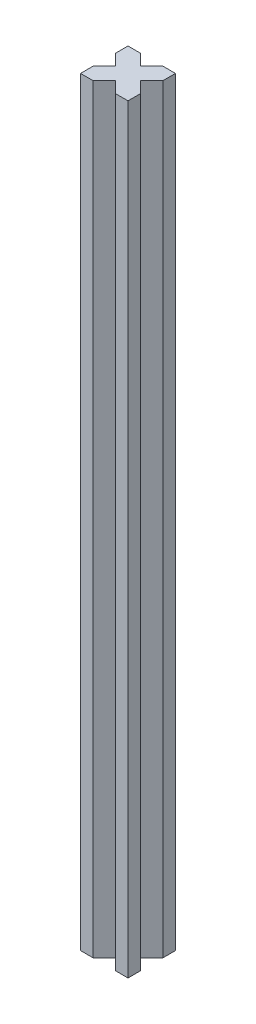
ISO-10303-21;
HEADER;
FILE_DESCRIPTION(('STEP AP214'),'2;1');
FILE_NAME('part.step','',(''),(''),'','','');
FILE_SCHEMA(('AUTOMOTIVE_DESIGN { 1 0 10303 214 1 1 1 1 }'));
ENDSEC;
DATA;
#1=APPLICATION_CONTEXT('core data for automotive mechanical design processes');
#2=APPLICATION_PROTOCOL_DEFINITION('international standard','automotive_design',2000,#1);
#3=PRODUCT_CONTEXT('',#1,'mechanical');
#4=PRODUCT('Part','Part','',(#3));
#5=PRODUCT_RELATED_PRODUCT_CATEGORY('part','',(#4));
#6=PRODUCT_DEFINITION_FORMATION('','',#4);
#7=PRODUCT_DEFINITION_CONTEXT('part definition',#1,'design');
#8=PRODUCT_DEFINITION('design','',#6,#7);
#9=PRODUCT_DEFINITION_SHAPE('','',#8);
#10=(LENGTH_UNIT() NAMED_UNIT(*) SI_UNIT(.MILLI.,.METRE.));
#11=(NAMED_UNIT(*) PLANE_ANGLE_UNIT() SI_UNIT($,.RADIAN.));
#12=(NAMED_UNIT(*) SI_UNIT($,.STERADIAN.) SOLID_ANGLE_UNIT());
#13=UNCERTAINTY_MEASURE_WITH_UNIT(LENGTH_MEASURE(1.E-05),#10,'distance_accuracy_value','');
#14=(GEOMETRIC_REPRESENTATION_CONTEXT(3) GLOBAL_UNCERTAINTY_ASSIGNED_CONTEXT((#13)) GLOBAL_UNIT_ASSIGNED_CONTEXT((#10,
#11,#12)) REPRESENTATION_CONTEXT('',''));
#15=CARTESIAN_POINT('',(0.,0.,0.));
#16=DIRECTION('',(0.,0.,1.));
#17=DIRECTION('',(1.,0.,0.));
#18=AXIS2_PLACEMENT_3D('',#15,#16,#17);
#19=CARTESIAN_POINT('',(4.00000000000001,240.,-15.));
#20=DIRECTION('',(-0.707106781186549,0.,0.707106781186546));
#21=DIRECTION('',(0.707106781186546,0.,0.707106781186549));
#22=AXIS2_PLACEMENT_3D('',#19,#20,#21);
#23=PLANE('',#22);
#24=DIRECTION('',(-0.707106781186546,0.,-0.707106781186549));
#25=VECTOR('',#24,1.);
#26=CARTESIAN_POINT('',(4.00000000000001,0.,-15.));
#27=LINE('',#26,#25);
#28=CARTESIAN_POINT('',(7.5,0.,-11.5));
#29=VERTEX_POINT('',#28);
#30=CARTESIAN_POINT('',(4.00000000000001,0.,-15.));
#31=VERTEX_POINT('',#30);
#32=EDGE_CURVE('E185',#29,#31,#27,.T.);
#33=ORIENTED_EDGE('',*,*,#32,.T.);
#34=DIRECTION('',(0.,-1.,0.));
#35=VECTOR('',#34,1.);
#36=CARTESIAN_POINT('',(4.00000000000001,240.,-15.));
#37=LINE('',#36,#35);
#38=CARTESIAN_POINT('',(4.00000000000001,240.,-15.));
#39=VERTEX_POINT('',#38);
#40=EDGE_CURVE('E11',#39,#31,#37,.T.);
#41=ORIENTED_EDGE('',*,*,#40,.F.);
#42=DIRECTION('',(-0.707106781186546,0.,-0.707106781186549));
#43=VECTOR('',#42,1.);
#44=CARTESIAN_POINT('',(4.00000000000001,240.,-15.));
#45=LINE('',#44,#43);
#46=CARTESIAN_POINT('',(7.5,240.,-11.5));
#47=VERTEX_POINT('',#46);
#48=EDGE_CURVE('E231',#47,#39,#45,.T.);
#49=ORIENTED_EDGE('',*,*,#48,.F.);
#50=DIRECTION('',(0.,-1.,0.));
#51=VECTOR('',#50,1.);
#52=CARTESIAN_POINT('',(7.5,240.,-11.5));
#53=LINE('',#52,#51);
#54=EDGE_CURVE('E181',#47,#29,#53,.T.);
#55=ORIENTED_EDGE('',*,*,#54,.T.);
#56=EDGE_LOOP('',(#33,#41,#49,#55));
#57=FACE_BOUND('',#56,.T.);
#58=ADVANCED_FACE('F36',(#57),#23,.F.);
#59=CARTESIAN_POINT('',(0.,240.,-15.));
#60=DIRECTION('',(0.,0.,1.));
#61=DIRECTION('',(1.,0.,0.));
#62=AXIS2_PLACEMENT_3D('',#59,#60,#61);
#63=PLANE('',#62);
#64=DIRECTION('',(-1.,0.,0.));
#65=VECTOR('',#64,1.);
#66=CARTESIAN_POINT('',(0.,0.,-15.));
#67=LINE('',#66,#65);
#68=CARTESIAN_POINT('',(0.,0.,-15.));
#69=VERTEX_POINT('',#68);
#70=EDGE_CURVE('E189',#31,#69,#67,.T.);
#71=ORIENTED_EDGE('',*,*,#70,.T.);
#72=DIRECTION('',(0.,-1.,0.));
#73=VECTOR('',#72,1.);
#74=CARTESIAN_POINT('',(0.,240.,-15.));
#75=LINE('',#74,#73);
#76=CARTESIAN_POINT('',(0.,240.,-15.));
#77=VERTEX_POINT('',#76);
#78=EDGE_CURVE('E45',#77,#69,#75,.T.);
#79=ORIENTED_EDGE('',*,*,#78,.F.);
#80=DIRECTION('',(-1.,0.,0.));
#81=VECTOR('',#80,1.);
#82=CARTESIAN_POINT('',(0.,240.,-15.));
#83=LINE('',#82,#81);
#84=EDGE_CURVE('E120',#39,#77,#83,.T.);
#85=ORIENTED_EDGE('',*,*,#84,.F.);
#86=ORIENTED_EDGE('',*,*,#40,.T.);
#87=EDGE_LOOP('',(#71,#79,#85,#86));
#88=FACE_BOUND('',#87,.T.);
#89=ADVANCED_FACE('F353',(#88),#63,.F.);
#90=CARTESIAN_POINT('',(0.,240.,-11.));
#91=DIRECTION('',(1.,0.,0.));
#92=DIRECTION('',(0.,0.,-1.));
#93=AXIS2_PLACEMENT_3D('',#90,#91,#92);
#94=PLANE('',#93);
#95=DIRECTION('',(0.,0.,1.));
#96=VECTOR('',#95,1.);
#97=CARTESIAN_POINT('',(0.,0.,-11.));
#98=LINE('',#97,#96);
#99=CARTESIAN_POINT('',(0.,0.,-11.));
#100=VERTEX_POINT('',#99);
#101=EDGE_CURVE('E192',#69,#100,#98,.T.);
#102=ORIENTED_EDGE('',*,*,#101,.T.);
#103=DIRECTION('',(0.,-1.,0.));
#104=VECTOR('',#103,1.);
#105=CARTESIAN_POINT('',(0.,240.,-11.));
#106=LINE('',#105,#104);
#107=CARTESIAN_POINT('',(0.,240.,-11.));
#108=VERTEX_POINT('',#107);
#109=EDGE_CURVE('E274',#108,#100,#106,.T.);
#110=ORIENTED_EDGE('',*,*,#109,.F.);
#111=DIRECTION('',(0.,0.,1.));
#112=VECTOR('',#111,1.);
#113=CARTESIAN_POINT('',(0.,240.,-11.));
#114=LINE('',#113,#112);
#115=EDGE_CURVE('E284',#77,#108,#114,.T.);
#116=ORIENTED_EDGE('',*,*,#115,.F.);
#117=ORIENTED_EDGE('',*,*,#78,.T.);
#118=EDGE_LOOP('',(#102,#110,#116,#117));
#119=FACE_BOUND('',#118,.T.);
#120=ADVANCED_FACE('F282',(#119),#94,.F.);
#121=CARTESIAN_POINT('',(3.5,240.,-7.5));
#122=DIRECTION('',(0.707106781186548,0.,-0.707106781186547));
#123=DIRECTION('',(-0.707106781186547,0.,-0.707106781186548));
#124=AXIS2_PLACEMENT_3D('',#121,#122,#123);
#125=PLANE('',#124);
#126=DIRECTION('',(0.707106781186547,0.,0.707106781186548));
#127=VECTOR('',#126,1.);
#128=CARTESIAN_POINT('',(3.5,0.,-7.5));
#129=LINE('',#128,#127);
#130=CARTESIAN_POINT('',(3.5,0.,-7.5));
#131=VERTEX_POINT('',#130);
#132=EDGE_CURVE('E195',#100,#131,#129,.T.);
#133=ORIENTED_EDGE('',*,*,#132,.T.);
#134=DIRECTION('',(0.,-1.,0.));
#135=VECTOR('',#134,1.);
#136=CARTESIAN_POINT('',(3.5,240.,-7.5));
#137=LINE('',#136,#135);
#138=CARTESIAN_POINT('',(3.5,240.,-7.5));
#139=VERTEX_POINT('',#138);
#140=EDGE_CURVE('E270',#139,#131,#137,.T.);
#141=ORIENTED_EDGE('',*,*,#140,.F.);
#142=DIRECTION('',(0.707106781186547,0.,0.707106781186548));
#143=VECTOR('',#142,1.);
#144=CARTESIAN_POINT('',(3.5,240.,-7.5));
#145=LINE('',#144,#143);
#146=EDGE_CURVE('E303',#108,#139,#145,.T.);
#147=ORIENTED_EDGE('',*,*,#146,.F.);
#148=ORIENTED_EDGE('',*,*,#109,.T.);
#149=EDGE_LOOP('',(#133,#141,#147,#148));
#150=FACE_BOUND('',#149,.T.);
#151=ADVANCED_FACE('F293',(#150),#125,.F.);
#152=CARTESIAN_POINT('',(0.,240.,-4.00000000000001));
#153=DIRECTION('',(0.707106781186546,0.,0.707106781186549));
#154=DIRECTION('',(0.707106781186549,0.,-0.707106781186546));
#155=AXIS2_PLACEMENT_3D('',#152,#153,#154);
#156=PLANE('',#155);
#157=DIRECTION('',(-0.707106781186549,0.,0.707106781186546));
#158=VECTOR('',#157,1.);
#159=CARTESIAN_POINT('',(0.,0.,-4.00000000000001));
#160=LINE('',#159,#158);
#161=CARTESIAN_POINT('',(0.,0.,-4.00000000000001));
#162=VERTEX_POINT('',#161);
#163=EDGE_CURVE('E198',#131,#162,#160,.T.);
#164=ORIENTED_EDGE('',*,*,#163,.T.);
#165=DIRECTION('',(0.,-1.,0.));
#166=VECTOR('',#165,1.);
#167=CARTESIAN_POINT('',(0.,240.,-4.00000000000001));
#168=LINE('',#167,#166);
#169=CARTESIAN_POINT('',(0.,240.,-4.00000000000001));
#170=VERTEX_POINT('',#169);
#171=EDGE_CURVE('E266',#170,#162,#168,.T.);
#172=ORIENTED_EDGE('',*,*,#171,.F.);
#173=DIRECTION('',(-0.707106781186549,0.,0.707106781186546));
#174=VECTOR('',#173,1.);
#175=CARTESIAN_POINT('',(0.,240.,-4.00000000000001));
#176=LINE('',#175,#174);
#177=EDGE_CURVE('E299',#139,#170,#176,.T.);
#178=ORIENTED_EDGE('',*,*,#177,.F.);
#179=ORIENTED_EDGE('',*,*,#140,.T.);
#180=EDGE_LOOP('',(#164,#172,#178,#179));
#181=FACE_BOUND('',#180,.T.);
#182=ADVANCED_FACE('F297',(#181),#156,.F.);
#183=CARTESIAN_POINT('',(0.,240.,0.));
#184=DIRECTION('',(1.,0.,0.));
#185=DIRECTION('',(0.,0.,-1.));
#186=AXIS2_PLACEMENT_3D('',#183,#184,#185);
#187=PLANE('',#186);
#188=DIRECTION('',(0.,0.,1.));
#189=VECTOR('',#188,1.);
#190=CARTESIAN_POINT('',(0.,0.,0.));
#191=LINE('',#190,#189);
#192=CARTESIAN_POINT('',(0.,0.,0.));
#193=VERTEX_POINT('',#192);
#194=EDGE_CURVE('E201',#162,#193,#191,.T.);
#195=ORIENTED_EDGE('',*,*,#194,.T.);
#196=DIRECTION('',(0.,-1.,0.));
#197=VECTOR('',#196,1.);
#198=CARTESIAN_POINT('',(0.,240.,0.));
#199=LINE('',#198,#197);
#200=CARTESIAN_POINT('',(0.,240.,0.));
#201=VERTEX_POINT('',#200);
#202=EDGE_CURVE('E262',#201,#193,#199,.T.);
#203=ORIENTED_EDGE('',*,*,#202,.F.);
#204=DIRECTION('',(0.,0.,1.));
#205=VECTOR('',#204,1.);
#206=CARTESIAN_POINT('',(0.,240.,0.));
#207=LINE('',#206,#205);
#208=EDGE_CURVE('E302',#170,#201,#207,.T.);
#209=ORIENTED_EDGE('',*,*,#208,.F.);
#210=ORIENTED_EDGE('',*,*,#171,.T.);
#211=EDGE_LOOP('',(#195,#203,#209,#210));
#212=FACE_BOUND('',#211,.T.);
#213=ADVANCED_FACE('F366',(#212),#187,.F.);
#214=CARTESIAN_POINT('',(0.,240.,0.));
#215=DIRECTION('',(0.,0.,-1.));
#216=DIRECTION('',(-1.,0.,0.));
#217=AXIS2_PLACEMENT_3D('',#214,#215,#216);
#218=PLANE('',#217);
#219=DIRECTION('',(1.,0.,0.));
#220=VECTOR('',#219,1.);
#221=CARTESIAN_POINT('',(0.,0.,0.));
#222=LINE('',#221,#220);
#223=CARTESIAN_POINT('',(4.00000000000004,0.,0.));
#224=VERTEX_POINT('',#223);
#225=EDGE_CURVE('E204',#193,#224,#222,.T.);
#226=ORIENTED_EDGE('',*,*,#225,.T.);
#227=DIRECTION('',(0.,-1.,0.));
#228=VECTOR('',#227,1.);
#229=CARTESIAN_POINT('',(4.00000000000004,240.,0.));
#230=LINE('',#229,#228);
#231=CARTESIAN_POINT('',(4.00000000000004,240.,0.));
#232=VERTEX_POINT('',#231);
#233=EDGE_CURVE('E258',#232,#224,#230,.T.);
#234=ORIENTED_EDGE('',*,*,#233,.F.);
#235=DIRECTION('',(1.,0.,0.));
#236=VECTOR('',#235,1.);
#237=CARTESIAN_POINT('',(0.,240.,0.));
#238=LINE('',#237,#236);
#239=EDGE_CURVE('E307',#201,#232,#238,.T.);
#240=ORIENTED_EDGE('',*,*,#239,.F.);
#241=ORIENTED_EDGE('',*,*,#202,.T.);
#242=EDGE_LOOP('',(#226,#234,#240,#241));
#243=FACE_BOUND('',#242,.T.);
#244=ADVANCED_FACE('F369',(#243),#218,.F.);
#245=CARTESIAN_POINT('',(7.5,240.,-3.5));
#246=DIRECTION('',(-0.707106781186551,0.,-0.707106781186544));
#247=DIRECTION('',(-0.707106781186544,0.,0.707106781186551));
#248=AXIS2_PLACEMENT_3D('',#245,#246,#247);
#249=PLANE('',#248);
#250=DIRECTION('',(0.707106781186544,0.,-0.707106781186551));
#251=VECTOR('',#250,1.);
#252=CARTESIAN_POINT('',(7.5,0.,-3.5));
#253=LINE('',#252,#251);
#254=CARTESIAN_POINT('',(7.5,0.,-3.5));
#255=VERTEX_POINT('',#254);
#256=EDGE_CURVE('E207',#224,#255,#253,.T.);
#257=ORIENTED_EDGE('',*,*,#256,.T.);
#258=DIRECTION('',(0.,-1.,0.));
#259=VECTOR('',#258,1.);
#260=CARTESIAN_POINT('',(7.5,240.,-3.5));
#261=LINE('',#260,#259);
#262=CARTESIAN_POINT('',(7.5,240.,-3.5));
#263=VERTEX_POINT('',#262);
#264=EDGE_CURVE('E254',#263,#255,#261,.T.);
#265=ORIENTED_EDGE('',*,*,#264,.F.);
#266=DIRECTION('',(0.707106781186544,0.,-0.707106781186551));
#267=VECTOR('',#266,1.);
#268=CARTESIAN_POINT('',(7.5,240.,-3.5));
#269=LINE('',#268,#267);
#270=EDGE_CURVE('E314',#232,#263,#269,.T.);
#271=ORIENTED_EDGE('',*,*,#270,.F.);
#272=ORIENTED_EDGE('',*,*,#233,.T.);
#273=EDGE_LOOP('',(#257,#265,#271,#272));
#274=FACE_BOUND('',#273,.T.);
#275=ADVANCED_FACE('F373',(#274),#249,.F.);
#276=CARTESIAN_POINT('',(11.,240.,0.));
#277=DIRECTION('',(0.707106781186544,0.,-0.707106781186551));
#278=DIRECTION('',(-0.707106781186551,0.,-0.707106781186544));
#279=AXIS2_PLACEMENT_3D('',#276,#277,#278);
#280=PLANE('',#279);
#281=DIRECTION('',(0.707106781186551,0.,0.707106781186544));
#282=VECTOR('',#281,1.);
#283=CARTESIAN_POINT('',(11.,0.,0.));
#284=LINE('',#283,#282);
#285=CARTESIAN_POINT('',(11.,0.,0.));
#286=VERTEX_POINT('',#285);
#287=EDGE_CURVE('E210',#255,#286,#284,.T.);
#288=ORIENTED_EDGE('',*,*,#287,.T.);
#289=DIRECTION('',(0.,-1.,0.));
#290=VECTOR('',#289,1.);
#291=CARTESIAN_POINT('',(11.,240.,0.));
#292=LINE('',#291,#290);
#293=CARTESIAN_POINT('',(11.,240.,0.));
#294=VERTEX_POINT('',#293);
#295=EDGE_CURVE('E250',#294,#286,#292,.T.);
#296=ORIENTED_EDGE('',*,*,#295,.F.);
#297=DIRECTION('',(0.707106781186551,0.,0.707106781186544));
#298=VECTOR('',#297,1.);
#299=CARTESIAN_POINT('',(11.,240.,0.));
#300=LINE('',#299,#298);
#301=EDGE_CURVE('E317',#263,#294,#300,.T.);
#302=ORIENTED_EDGE('',*,*,#301,.F.);
#303=ORIENTED_EDGE('',*,*,#264,.T.);
#304=EDGE_LOOP('',(#288,#296,#302,#303));
#305=FACE_BOUND('',#304,.T.);
#306=ADVANCED_FACE('F377',(#305),#280,.F.);
#307=CARTESIAN_POINT('',(11.,240.,0.));
#308=DIRECTION('',(0.,0.,-1.));
#309=DIRECTION('',(-1.,0.,0.));
#310=AXIS2_PLACEMENT_3D('',#307,#308,#309);
#311=PLANE('',#310);
#312=DIRECTION('',(1.,0.,0.));
#313=VECTOR('',#312,1.);
#314=CARTESIAN_POINT('',(11.,0.,0.));
#315=LINE('',#314,#313);
#316=CARTESIAN_POINT('',(15.,0.,0.));
#317=VERTEX_POINT('',#316);
#318=EDGE_CURVE('E213',#286,#317,#315,.T.);
#319=ORIENTED_EDGE('',*,*,#318,.T.);
#320=DIRECTION('',(0.,-1.,0.));
#321=VECTOR('',#320,1.);
#322=CARTESIAN_POINT('',(15.,240.,0.));
#323=LINE('',#322,#321);
#324=CARTESIAN_POINT('',(15.,240.,0.));
#325=VERTEX_POINT('',#324);
#326=EDGE_CURVE('E246',#325,#317,#323,.T.);
#327=ORIENTED_EDGE('',*,*,#326,.F.);
#328=DIRECTION('',(1.,0.,0.));
#329=VECTOR('',#328,1.);
#330=CARTESIAN_POINT('',(11.,240.,0.));
#331=LINE('',#330,#329);
#332=EDGE_CURVE('E320',#294,#325,#331,.T.);
#333=ORIENTED_EDGE('',*,*,#332,.F.);
#334=ORIENTED_EDGE('',*,*,#295,.T.);
#335=EDGE_LOOP('',(#319,#327,#333,#334));
#336=FACE_BOUND('',#335,.T.);
#337=ADVANCED_FACE('F381',(#336),#311,.F.);
#338=CARTESIAN_POINT('',(15.,240.,0.));
#339=DIRECTION('',(-1.,0.,0.));
#340=DIRECTION('',(0.,0.,1.));
#341=AXIS2_PLACEMENT_3D('',#338,#339,#340);
#342=PLANE('',#341);
#343=DIRECTION('',(0.,0.,-1.));
#344=VECTOR('',#343,1.);
#345=CARTESIAN_POINT('',(15.,0.,0.));
#346=LINE('',#345,#344);
#347=CARTESIAN_POINT('',(15.,0.,-3.99999999999996));
#348=VERTEX_POINT('',#347);
#349=EDGE_CURVE('E216',#317,#348,#346,.T.);
#350=ORIENTED_EDGE('',*,*,#349,.T.);
#351=DIRECTION('',(0.,-1.,0.));
#352=VECTOR('',#351,1.);
#353=CARTESIAN_POINT('',(15.,240.,-3.99999999999996));
#354=LINE('',#353,#352);
#355=CARTESIAN_POINT('',(15.,240.,-3.99999999999996));
#356=VERTEX_POINT('',#355);
#357=EDGE_CURVE('E242',#356,#348,#354,.T.);
#358=ORIENTED_EDGE('',*,*,#357,.F.);
#359=DIRECTION('',(0.,0.,-1.));
#360=VECTOR('',#359,1.);
#361=CARTESIAN_POINT('',(15.,240.,0.));
#362=LINE('',#361,#360);
#363=EDGE_CURVE('E323',#325,#356,#362,.T.);
#364=ORIENTED_EDGE('',*,*,#363,.F.);
#365=ORIENTED_EDGE('',*,*,#326,.T.);
#366=EDGE_LOOP('',(#350,#358,#364,#365));
#367=FACE_BOUND('',#366,.T.);
#368=ADVANCED_FACE('F385',(#367),#342,.F.);
#369=CARTESIAN_POINT('',(11.5,240.,-7.5));
#370=DIRECTION('',(-0.707106781186551,0.,0.707106781186544));
#371=DIRECTION('',(0.707106781186544,0.,0.707106781186551));
#372=AXIS2_PLACEMENT_3D('',#369,#370,#371);
#373=PLANE('',#372);
#374=DIRECTION('',(-0.707106781186544,0.,-0.707106781186551));
#375=VECTOR('',#374,1.);
#376=CARTESIAN_POINT('',(11.5,0.,-7.5));
#377=LINE('',#376,#375);
#378=CARTESIAN_POINT('',(11.5,0.,-7.5));
#379=VERTEX_POINT('',#378);
#380=EDGE_CURVE('E219',#348,#379,#377,.T.);
#381=ORIENTED_EDGE('',*,*,#380,.T.);
#382=DIRECTION('',(0.,-1.,0.));
#383=VECTOR('',#382,1.);
#384=CARTESIAN_POINT('',(11.5,240.,-7.5));
#385=LINE('',#384,#383);
#386=CARTESIAN_POINT('',(11.5,240.,-7.5));
#387=VERTEX_POINT('',#386);
#388=EDGE_CURVE('E238',#387,#379,#385,.T.);
#389=ORIENTED_EDGE('',*,*,#388,.F.);
#390=DIRECTION('',(-0.707106781186544,0.,-0.707106781186551));
#391=VECTOR('',#390,1.);
#392=CARTESIAN_POINT('',(11.5,240.,-7.5));
#393=LINE('',#392,#391);
#394=EDGE_CURVE('E326',#356,#387,#393,.T.);
#395=ORIENTED_EDGE('',*,*,#394,.F.);
#396=ORIENTED_EDGE('',*,*,#357,.T.);
#397=EDGE_LOOP('',(#381,#389,#395,#396));
#398=FACE_BOUND('',#397,.T.);
#399=ADVANCED_FACE('F334',(#398),#373,.F.);
#400=CARTESIAN_POINT('',(15.,240.,-11.));
#401=DIRECTION('',(-0.707106781186544,0.,-0.707106781186551));
#402=DIRECTION('',(-0.707106781186551,0.,0.707106781186544));
#403=AXIS2_PLACEMENT_3D('',#400,#401,#402);
#404=PLANE('',#403);
#405=DIRECTION('',(0.707106781186551,0.,-0.707106781186544));
#406=VECTOR('',#405,1.);
#407=CARTESIAN_POINT('',(15.,0.,-11.));
#408=LINE('',#407,#406);
#409=CARTESIAN_POINT('',(15.,0.,-11.));
#410=VERTEX_POINT('',#409);
#411=EDGE_CURVE('E222',#379,#410,#408,.T.);
#412=ORIENTED_EDGE('',*,*,#411,.T.);
#413=DIRECTION('',(0.,-1.,0.));
#414=VECTOR('',#413,1.);
#415=CARTESIAN_POINT('',(15.,240.,-11.));
#416=LINE('',#415,#414);
#417=CARTESIAN_POINT('',(15.,240.,-11.));
#418=VERTEX_POINT('',#417);
#419=EDGE_CURVE('E174',#418,#410,#416,.T.);
#420=ORIENTED_EDGE('',*,*,#419,.F.);
#421=DIRECTION('',(0.707106781186551,0.,-0.707106781186544));
#422=VECTOR('',#421,1.);
#423=CARTESIAN_POINT('',(15.,240.,-11.));
#424=LINE('',#423,#422);
#425=EDGE_CURVE('E163',#387,#418,#424,.T.);
#426=ORIENTED_EDGE('',*,*,#425,.F.);
#427=ORIENTED_EDGE('',*,*,#388,.T.);
#428=EDGE_LOOP('',(#412,#420,#426,#427));
#429=FACE_BOUND('',#428,.T.);
#430=ADVANCED_FACE('F338',(#429),#404,.F.);
#431=CARTESIAN_POINT('',(15.,240.,-11.));
#432=DIRECTION('',(-1.,0.,0.));
#433=DIRECTION('',(0.,0.,1.));
#434=AXIS2_PLACEMENT_3D('',#431,#432,#433);
#435=PLANE('',#434);
#436=DIRECTION('',(0.,0.,-1.));
#437=VECTOR('',#436,1.);
#438=CARTESIAN_POINT('',(15.,0.,-11.));
#439=LINE('',#438,#437);
#440=CARTESIAN_POINT('',(15.,0.,-15.));
#441=VERTEX_POINT('',#440);
#442=EDGE_CURVE('E172',#410,#441,#439,.T.);
#443=ORIENTED_EDGE('',*,*,#442,.T.);
#444=DIRECTION('',(0.,-1.,0.));
#445=VECTOR('',#444,1.);
#446=CARTESIAN_POINT('',(15.,240.,-15.));
#447=LINE('',#446,#445);
#448=CARTESIAN_POINT('',(15.,240.,-15.));
#449=VERTEX_POINT('',#448);
#450=EDGE_CURVE('E169',#449,#441,#447,.T.);
#451=ORIENTED_EDGE('',*,*,#450,.F.);
#452=DIRECTION('',(0.,0.,-1.));
#453=VECTOR('',#452,1.);
#454=CARTESIAN_POINT('',(15.,240.,-11.));
#455=LINE('',#454,#453);
#456=EDGE_CURVE('E157',#418,#449,#455,.T.);
#457=ORIENTED_EDGE('',*,*,#456,.F.);
#458=ORIENTED_EDGE('',*,*,#419,.T.);
#459=EDGE_LOOP('',(#443,#451,#457,#458));
#460=FACE_BOUND('',#459,.T.);
#461=ADVANCED_FACE('F170',(#460),#435,.F.);
#462=CARTESIAN_POINT('',(11.,240.,-15.));
#463=DIRECTION('',(0.,0.,1.));
#464=DIRECTION('',(1.,0.,0.));
#465=AXIS2_PLACEMENT_3D('',#462,#463,#464);
#466=PLANE('',#465);
#467=DIRECTION('',(-1.,0.,0.));
#468=VECTOR('',#467,1.);
#469=CARTESIAN_POINT('',(11.,0.,-15.));
#470=LINE('',#469,#468);
#471=CARTESIAN_POINT('',(11.,0.,-15.));
#472=VERTEX_POINT('',#471);
#473=EDGE_CURVE('E106',#441,#472,#470,.T.);
#474=ORIENTED_EDGE('',*,*,#473,.T.);
#475=DIRECTION('',(0.,-1.,0.));
#476=VECTOR('',#475,1.);
#477=CARTESIAN_POINT('',(11.,240.,-15.));
#478=LINE('',#477,#476);
#479=CARTESIAN_POINT('',(11.,240.,-15.));
#480=VERTEX_POINT('',#479);
#481=EDGE_CURVE('E175',#480,#472,#478,.T.);
#482=ORIENTED_EDGE('',*,*,#481,.F.);
#483=DIRECTION('',(-1.,0.,0.));
#484=VECTOR('',#483,1.);
#485=CARTESIAN_POINT('',(11.,240.,-15.));
#486=LINE('',#485,#484);
#487=EDGE_CURVE('E161',#449,#480,#486,.T.);
#488=ORIENTED_EDGE('',*,*,#487,.F.);
#489=ORIENTED_EDGE('',*,*,#450,.T.);
#490=EDGE_LOOP('',(#474,#482,#488,#489));
#491=FACE_BOUND('',#490,.T.);
#492=ADVANCED_FACE('F177',(#491),#466,.F.);
#493=CARTESIAN_POINT('',(7.5,240.,-11.5));
#494=DIRECTION('',(0.707106781186547,0.,0.707106781186548));
#495=DIRECTION('',(0.707106781186548,0.,-0.707106781186547));
#496=AXIS2_PLACEMENT_3D('',#493,#494,#495);
#497=PLANE('',#496);
#498=DIRECTION('',(-0.707106781186548,0.,0.707106781186547));
#499=VECTOR('',#498,1.);
#500=CARTESIAN_POINT('',(7.5,0.,-11.5));
#501=LINE('',#500,#499);
#502=EDGE_CURVE('E112',#472,#29,#501,.T.);
#503=ORIENTED_EDGE('',*,*,#502,.T.);
#504=ORIENTED_EDGE('',*,*,#54,.F.);
#505=DIRECTION('',(-0.707106781186548,0.,0.707106781186547));
#506=VECTOR('',#505,1.);
#507=CARTESIAN_POINT('',(7.5,240.,-11.5));
#508=LINE('',#507,#506);
#509=EDGE_CURVE('E53',#480,#47,#508,.T.);
#510=ORIENTED_EDGE('',*,*,#509,.F.);
#511=ORIENTED_EDGE('',*,*,#481,.T.);
#512=EDGE_LOOP('',(#503,#504,#510,#511));
#513=FACE_BOUND('',#512,.T.);
#514=ADVANCED_FACE('F342',(#513),#497,.F.);
#515=CARTESIAN_POINT('',(0.,240.,0.));
#516=DIRECTION('',(0.,1.,0.));
#517=DIRECTION('',(0.,0.,1.));
#518=AXIS2_PLACEMENT_3D('',#515,#516,#517);
#519=PLANE('',#518);
#520=ORIENTED_EDGE('',*,*,#48,.T.);
#521=ORIENTED_EDGE('',*,*,#84,.T.);
#522=ORIENTED_EDGE('',*,*,#115,.T.);
#523=ORIENTED_EDGE('',*,*,#146,.T.);
#524=ORIENTED_EDGE('',*,*,#177,.T.);
#525=ORIENTED_EDGE('',*,*,#208,.T.);
#526=ORIENTED_EDGE('',*,*,#239,.T.);
#527=ORIENTED_EDGE('',*,*,#270,.T.);
#528=ORIENTED_EDGE('',*,*,#301,.T.);
#529=ORIENTED_EDGE('',*,*,#332,.T.);
#530=ORIENTED_EDGE('',*,*,#363,.T.);
#531=ORIENTED_EDGE('',*,*,#394,.T.);
#532=ORIENTED_EDGE('',*,*,#425,.T.);
#533=ORIENTED_EDGE('',*,*,#456,.T.);
#534=ORIENTED_EDGE('',*,*,#487,.T.);
#535=ORIENTED_EDGE('',*,*,#509,.T.);
#536=EDGE_LOOP('',(#520,#521,#522,#523,#524,#525,#526,#527,#528,#529,#530,#531,#532,#533,#534,#535));
#537=FACE_BOUND('',#536,.T.);
#538=ADVANCED_FACE('F159',(#537),#519,.T.);
#539=CARTESIAN_POINT('',(0.,0.,0.));
#540=DIRECTION('',(0.,1.,0.));
#541=DIRECTION('',(0.,0.,1.));
#542=AXIS2_PLACEMENT_3D('',#539,#540,#541);
#543=PLANE('',#542);
#544=ORIENTED_EDGE('',*,*,#32,.F.);
#545=ORIENTED_EDGE('',*,*,#502,.F.);
#546=ORIENTED_EDGE('',*,*,#473,.F.);
#547=ORIENTED_EDGE('',*,*,#442,.F.);
#548=ORIENTED_EDGE('',*,*,#411,.F.);
#549=ORIENTED_EDGE('',*,*,#380,.F.);
#550=ORIENTED_EDGE('',*,*,#349,.F.);
#551=ORIENTED_EDGE('',*,*,#318,.F.);
#552=ORIENTED_EDGE('',*,*,#287,.F.);
#553=ORIENTED_EDGE('',*,*,#256,.F.);
#554=ORIENTED_EDGE('',*,*,#225,.F.);
#555=ORIENTED_EDGE('',*,*,#194,.F.);
#556=ORIENTED_EDGE('',*,*,#163,.F.);
#557=ORIENTED_EDGE('',*,*,#132,.F.);
#558=ORIENTED_EDGE('',*,*,#101,.F.);
#559=ORIENTED_EDGE('',*,*,#70,.F.);
#560=EDGE_LOOP('',(#544,#545,#546,#547,#548,#549,#550,#551,#552,#553,#554,#555,#556,#557,#558,#559));
#561=FACE_BOUND('',#560,.T.);
#562=ADVANCED_FACE('F288',(#561),#543,.F.);
#563=CLOSED_SHELL('',(#58,#89,#120,#151,#182,#213,#244,#275,#306,#337,#368,#399,#430,#461,#492,
#514,#538,#562));
#564=MANIFOLD_SOLID_BREP('B2',#563);
#565=ADVANCED_BREP_SHAPE_REPRESENTATION('',(#18,#564),#14);
#566=SHAPE_DEFINITION_REPRESENTATION(#9,#565);
ENDSEC;
END-ISO-10303-21;
